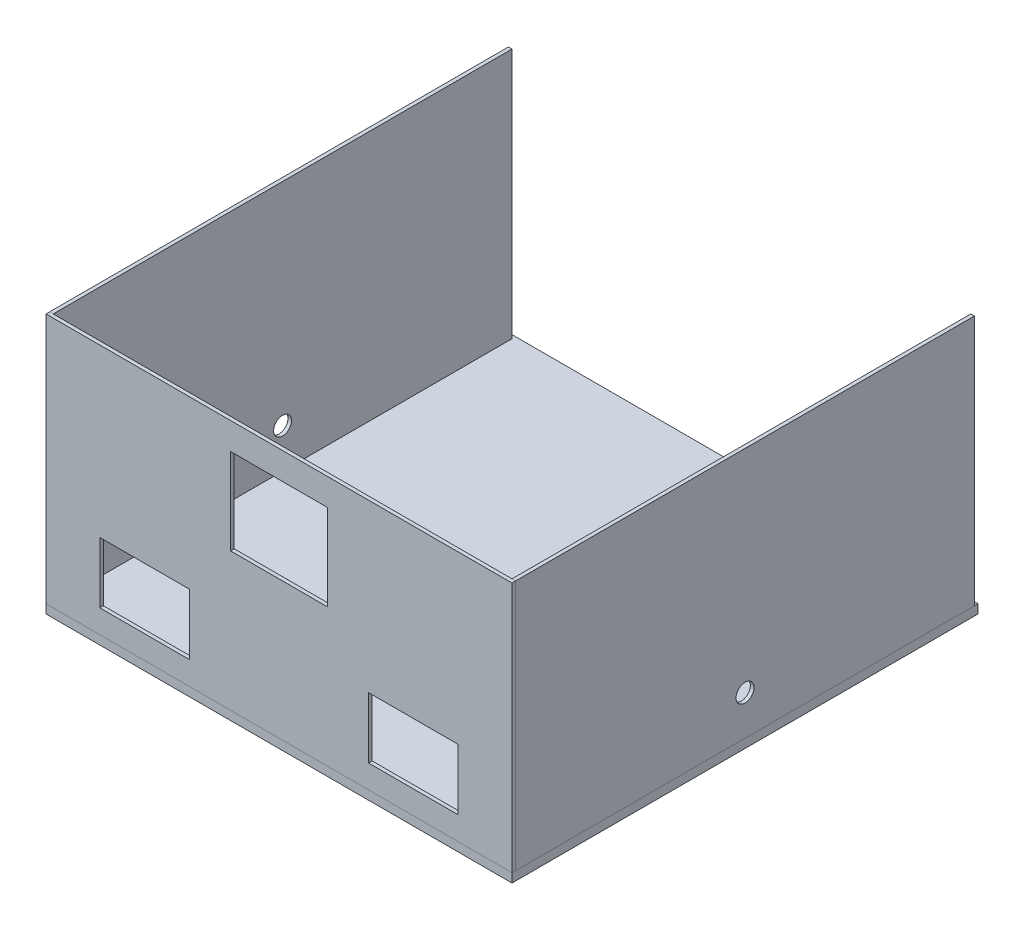
ISO-10303-21;
HEADER;
FILE_DESCRIPTION(('STEP AP214'),'2;1');
FILE_NAME('part.step','',(''),(''),'','','');
FILE_SCHEMA(('AUTOMOTIVE_DESIGN { 1 0 10303 214 1 1 1 1 }'));
ENDSEC;
DATA;
#1=APPLICATION_CONTEXT('core data for automotive mechanical design processes');
#2=APPLICATION_PROTOCOL_DEFINITION('international standard','automotive_design',2000,#1);
#3=PRODUCT_CONTEXT('',#1,'mechanical');
#4=PRODUCT('Part','Part','',(#3));
#5=PRODUCT_RELATED_PRODUCT_CATEGORY('part','',(#4));
#6=PRODUCT_DEFINITION_FORMATION('','',#4);
#7=PRODUCT_DEFINITION_CONTEXT('part definition',#1,'design');
#8=PRODUCT_DEFINITION('design','',#6,#7);
#9=PRODUCT_DEFINITION_SHAPE('','',#8);
#10=(LENGTH_UNIT() NAMED_UNIT(*) SI_UNIT(.MILLI.,.METRE.));
#11=(NAMED_UNIT(*) PLANE_ANGLE_UNIT() SI_UNIT($,.RADIAN.));
#12=(NAMED_UNIT(*) SI_UNIT($,.STERADIAN.) SOLID_ANGLE_UNIT());
#13=UNCERTAINTY_MEASURE_WITH_UNIT(LENGTH_MEASURE(1.E-05),#10,'distance_accuracy_value','');
#14=(GEOMETRIC_REPRESENTATION_CONTEXT(3) GLOBAL_UNCERTAINTY_ASSIGNED_CONTEXT((#13)) GLOBAL_UNIT_ASSIGNED_CONTEXT((#10,
#11,#12)) REPRESENTATION_CONTEXT('',''));
#15=CARTESIAN_POINT('',(0.,0.,0.));
#16=DIRECTION('',(0.,0.,1.));
#17=DIRECTION('',(1.,0.,0.));
#18=AXIS2_PLACEMENT_3D('',#15,#16,#17);
#19=CARTESIAN_POINT('',(124.072532436243,59.5515225903268,165.701661341962));
#20=DIRECTION('',(-1.,0.,0.));
#21=DIRECTION('',(0.,0.,1.));
#22=AXIS2_PLACEMENT_3D('',#19,#20,#21);
#23=PLANE('',#22);
#24=DIRECTION('',(0.,0.,-1.));
#25=VECTOR('',#24,1.);
#26=CARTESIAN_POINT('',(124.072532436243,57.0515225903268,165.701661341962));
#27=LINE('',#26,#25);
#28=CARTESIAN_POINT('',(124.072532436243,57.0515225903268,165.701661341962));
#29=VERTEX_POINT('',#28);
#30=CARTESIAN_POINT('',(124.072532436243,57.0515225903268,35.7016613419616));
#31=VERTEX_POINT('',#30);
#32=EDGE_CURVE('P0_E80',#29,#31,#27,.T.);
#33=ORIENTED_EDGE('',*,*,#32,.T.);
#34=DIRECTION('',(0.,-1.,0.));
#35=VECTOR('',#34,1.);
#36=CARTESIAN_POINT('',(124.072532436243,59.5515225903268,35.7016613419616));
#37=LINE('',#36,#35);
#38=CARTESIAN_POINT('',(124.072532436243,59.5515225903268,35.7016613419616));
#39=VERTEX_POINT('',#38);
#40=EDGE_CURVE('P0_E11',#39,#31,#37,.T.);
#41=ORIENTED_EDGE('',*,*,#40,.F.);
#42=DIRECTION('',(0.,0.,-1.));
#43=VECTOR('',#42,1.);
#44=CARTESIAN_POINT('',(124.072532436243,59.5515225903268,165.701661341962));
#45=LINE('',#44,#43);
#46=CARTESIAN_POINT('',(124.072532436243,59.5515225903268,165.701661341962));
#47=VERTEX_POINT('',#46);
#48=EDGE_CURVE('P0_E68',#47,#39,#45,.T.);
#49=ORIENTED_EDGE('',*,*,#48,.F.);
#50=DIRECTION('',(0.,-1.,0.));
#51=VECTOR('',#50,1.);
#52=CARTESIAN_POINT('',(124.072532436243,59.5515225903268,165.701661341962));
#53=LINE('',#52,#51);
#54=EDGE_CURVE('P0_E76',#47,#29,#53,.T.);
#55=ORIENTED_EDGE('',*,*,#54,.T.);
#56=EDGE_LOOP('',(#33,#41,#49,#55));
#57=FACE_BOUND('',#56,.T.);
#58=ADVANCED_FACE('P0_F17',(#57),#23,.F.);
#59=CARTESIAN_POINT('',(-5.92746756375711,59.5515225903268,35.7016613419616));
#60=DIRECTION('',(0.,0.,1.));
#61=DIRECTION('',(1.,0.,0.));
#62=AXIS2_PLACEMENT_3D('',#59,#60,#61);
#63=PLANE('',#62);
#64=DIRECTION('',(-1.,0.,0.));
#65=VECTOR('',#64,1.);
#66=CARTESIAN_POINT('',(-5.92746756375711,57.0515225903268,35.7016613419616));
#67=LINE('',#66,#65);
#68=CARTESIAN_POINT('',(-5.92746756375711,57.0515225903268,35.7016613419616));
#69=VERTEX_POINT('',#68);
#70=EDGE_CURVE('P0_E72',#31,#69,#67,.T.);
#71=ORIENTED_EDGE('',*,*,#70,.T.);
#72=DIRECTION('',(0.,-1.,0.));
#73=VECTOR('',#72,1.);
#74=CARTESIAN_POINT('',(-5.92746756375711,59.5515225903268,35.7016613419616));
#75=LINE('',#74,#73);
#76=CARTESIAN_POINT('',(-5.92746756375711,59.5515225903268,35.7016613419616));
#77=VERTEX_POINT('',#76);
#78=EDGE_CURVE('P0_E25',#77,#69,#75,.T.);
#79=ORIENTED_EDGE('',*,*,#78,.F.);
#80=DIRECTION('',(-1.,0.,0.));
#81=VECTOR('',#80,1.);
#82=CARTESIAN_POINT('',(-5.92746756375711,59.5515225903268,35.7016613419616));
#83=LINE('',#82,#81);
#84=EDGE_CURVE('P0_E63',#39,#77,#83,.T.);
#85=ORIENTED_EDGE('',*,*,#84,.F.);
#86=ORIENTED_EDGE('',*,*,#40,.T.);
#87=EDGE_LOOP('',(#71,#79,#85,#86));
#88=FACE_BOUND('',#87,.T.);
#89=ADVANCED_FACE('P0_F71',(#88),#63,.F.);
#90=CARTESIAN_POINT('',(-5.92746756375711,59.5515225903268,165.701661341962));
#91=DIRECTION('',(1.,0.,0.));
#92=DIRECTION('',(0.,0.,-1.));
#93=AXIS2_PLACEMENT_3D('',#90,#91,#92);
#94=PLANE('',#93);
#95=DIRECTION('',(0.,0.,1.));
#96=VECTOR('',#95,1.);
#97=CARTESIAN_POINT('',(-5.92746756375711,57.0515225903268,165.701661341962));
#98=LINE('',#97,#96);
#99=CARTESIAN_POINT('',(-5.92746756375711,57.0515225903268,165.701661341962));
#100=VERTEX_POINT('',#99);
#101=EDGE_CURVE('P0_E50',#69,#100,#98,.T.);
#102=ORIENTED_EDGE('',*,*,#101,.T.);
#103=DIRECTION('',(0.,-1.,0.));
#104=VECTOR('',#103,1.);
#105=CARTESIAN_POINT('',(-5.92746756375711,59.5515225903268,165.701661341962));
#106=LINE('',#105,#104);
#107=CARTESIAN_POINT('',(-5.92746756375711,59.5515225903268,165.701661341962));
#108=VERTEX_POINT('',#107);
#109=EDGE_CURVE('P0_E73',#108,#100,#106,.T.);
#110=ORIENTED_EDGE('',*,*,#109,.F.);
#111=DIRECTION('',(0.,0.,1.));
#112=VECTOR('',#111,1.);
#113=CARTESIAN_POINT('',(-5.92746756375711,59.5515225903268,165.701661341962));
#114=LINE('',#113,#112);
#115=EDGE_CURVE('P0_E66',#77,#108,#114,.T.);
#116=ORIENTED_EDGE('',*,*,#115,.F.);
#117=ORIENTED_EDGE('',*,*,#78,.T.);
#118=EDGE_LOOP('',(#102,#110,#116,#117));
#119=FACE_BOUND('',#118,.T.);
#120=ADVANCED_FACE('P0_F74',(#119),#94,.F.);
#121=CARTESIAN_POINT('',(-5.92746756375711,59.5515225903268,165.701661341962));
#122=DIRECTION('',(0.,0.,-1.));
#123=DIRECTION('',(-1.,0.,0.));
#124=AXIS2_PLACEMENT_3D('',#121,#122,#123);
#125=PLANE('',#124);
#126=DIRECTION('',(1.,0.,0.));
#127=VECTOR('',#126,1.);
#128=CARTESIAN_POINT('',(-5.92746756375711,57.0515225903268,165.701661341962));
#129=LINE('',#128,#127);
#130=EDGE_CURVE('P0_E56',#100,#29,#129,.T.);
#131=ORIENTED_EDGE('',*,*,#130,.T.);
#132=ORIENTED_EDGE('',*,*,#54,.F.);
#133=DIRECTION('',(1.,0.,0.));
#134=VECTOR('',#133,1.);
#135=CARTESIAN_POINT('',(-5.92746756375711,59.5515225903268,165.701661341962));
#136=LINE('',#135,#134);
#137=EDGE_CURVE('P0_E33',#108,#47,#136,.T.);
#138=ORIENTED_EDGE('',*,*,#137,.F.);
#139=ORIENTED_EDGE('',*,*,#109,.T.);
#140=EDGE_LOOP('',(#131,#132,#138,#139));
#141=FACE_BOUND('',#140,.T.);
#142=ADVANCED_FACE('P0_F87',(#141),#125,.F.);
#143=CARTESIAN_POINT('',(59.0725324362429,59.5515225903268,100.701661341962));
#144=DIRECTION('',(0.,-1.,0.));
#145=DIRECTION('',(0.,0.,-1.));
#146=AXIS2_PLACEMENT_3D('',#143,#144,#145);
#147=PLANE('',#146);
#148=ORIENTED_EDGE('',*,*,#48,.T.);
#149=ORIENTED_EDGE('',*,*,#84,.T.);
#150=ORIENTED_EDGE('',*,*,#115,.T.);
#151=ORIENTED_EDGE('',*,*,#137,.T.);
#152=EDGE_LOOP('',(#148,#149,#150,#151));
#153=FACE_BOUND('',#152,.T.);
#154=ADVANCED_FACE('P0_F64',(#153),#147,.F.);
#155=CARTESIAN_POINT('',(59.0725324362429,57.0515225903268,100.701661341962));
#156=DIRECTION('',(0.,-1.,0.));
#157=DIRECTION('',(0.,0.,-1.));
#158=AXIS2_PLACEMENT_3D('',#155,#156,#157);
#159=PLANE('',#158);
#160=ORIENTED_EDGE('',*,*,#32,.F.);
#161=ORIENTED_EDGE('',*,*,#130,.F.);
#162=ORIENTED_EDGE('',*,*,#101,.F.);
#163=ORIENTED_EDGE('',*,*,#70,.F.);
#164=EDGE_LOOP('',(#160,#161,#162,#163));
#165=FACE_BOUND('',#164,.T.);
#166=ADVANCED_FACE('P0_F90',(#165),#159,.T.);
#167=CLOSED_SHELL('',(#58,#89,#120,#142,#154,#166));
#168=MANIFOLD_SOLID_BREP('P0_B1',#167);
#169=CARTESIAN_POINT('',(124.072532436243,59.5515225903268,165.701661341962));
#170=DIRECTION('',(-1.,0.,0.));
#171=DIRECTION('',(0.,0.,1.));
#172=AXIS2_PLACEMENT_3D('',#169,#170,#171);
#173=PLANE('',#172);
#174=DIRECTION('',(0.,1.,0.));
#175=VECTOR('',#174,1.);
#176=CARTESIAN_POINT('',(124.072532436243,59.5515225903268,164.701661341962));
#177=LINE('',#176,#175);
#178=CARTESIAN_POINT('',(124.072532436243,59.5515225903268,164.701661341962));
#179=VERTEX_POINT('',#178);
#180=CARTESIAN_POINT('',(124.072532436243,129.551522590327,164.701661341962));
#181=VERTEX_POINT('',#180);
#182=EDGE_CURVE('P1_E165',#179,#181,#177,.T.);
#183=ORIENTED_EDGE('',*,*,#182,.T.);
#184=DIRECTION('',(0.,0.,-1.));
#185=VECTOR('',#184,1.);
#186=CARTESIAN_POINT('',(124.072532436243,129.551522590327,165.701661341962));
#187=LINE('',#186,#185);
#188=CARTESIAN_POINT('',(124.072532436243,129.551522590327,165.701661341962));
#189=VERTEX_POINT('',#188);
#190=EDGE_CURVE('P1_E10',#189,#181,#187,.T.);
#191=ORIENTED_EDGE('',*,*,#190,.F.);
#192=DIRECTION('',(0.,1.,0.));
#193=VECTOR('',#192,1.);
#194=CARTESIAN_POINT('',(124.072532436243,59.5515225903268,165.701661341962));
#195=LINE('',#194,#193);
#196=CARTESIAN_POINT('',(124.072532436243,59.5515225903268,165.701661341962));
#197=VERTEX_POINT('',#196);
#198=EDGE_CURVE('P1_E230',#197,#189,#195,.T.);
#199=ORIENTED_EDGE('',*,*,#198,.F.);
#200=DIRECTION('',(0.,0.,-1.));
#201=VECTOR('',#200,1.);
#202=CARTESIAN_POINT('',(124.072532436243,59.5515225903268,165.701661341962));
#203=LINE('',#202,#201);
#204=EDGE_CURVE('P1_E240',#197,#179,#203,.T.);
#205=ORIENTED_EDGE('',*,*,#204,.T.);
#206=EDGE_LOOP('',(#183,#191,#199,#205));
#207=FACE_BOUND('',#206,.T.);
#208=ADVANCED_FACE('P1_F16',(#207),#173,.F.);
#209=CARTESIAN_POINT('',(-5.92746756375711,129.551522590327,165.701661341962));
#210=DIRECTION('',(0.,-1.,0.));
#211=DIRECTION('',(0.,0.,-1.));
#212=AXIS2_PLACEMENT_3D('',#209,#210,#211);
#213=PLANE('',#212);
#214=DIRECTION('',(-1.,0.,0.));
#215=VECTOR('',#214,1.);
#216=CARTESIAN_POINT('',(-5.92746756375711,129.551522590327,164.701661341962));
#217=LINE('',#216,#215);
#218=CARTESIAN_POINT('',(-5.92746756375711,129.551522590327,164.701661341962));
#219=VERTEX_POINT('',#218);
#220=EDGE_CURVE('P1_E243',#181,#219,#217,.T.);
#221=ORIENTED_EDGE('',*,*,#220,.T.);
#222=DIRECTION('',(0.,0.,-1.));
#223=VECTOR('',#222,1.);
#224=CARTESIAN_POINT('',(-5.92746756375711,129.551522590327,165.701661341962));
#225=LINE('',#224,#223);
#226=CARTESIAN_POINT('',(-5.92746756375711,129.551522590327,165.701661341962));
#227=VERTEX_POINT('',#226);
#228=EDGE_CURVE('P1_E23',#227,#219,#225,.T.);
#229=ORIENTED_EDGE('',*,*,#228,.F.);
#230=DIRECTION('',(-1.,0.,0.));
#231=VECTOR('',#230,1.);
#232=CARTESIAN_POINT('',(-5.92746756375711,129.551522590327,165.701661341962));
#233=LINE('',#232,#231);
#234=EDGE_CURVE('P1_E233',#189,#227,#233,.T.);
#235=ORIENTED_EDGE('',*,*,#234,.F.);
#236=ORIENTED_EDGE('',*,*,#190,.T.);
#237=EDGE_LOOP('',(#221,#229,#235,#236));
#238=FACE_BOUND('',#237,.T.);
#239=ADVANCED_FACE('P1_F272',(#238),#213,.F.);
#240=CARTESIAN_POINT('',(-5.92746756375711,59.5515225903268,165.701661341962));
#241=DIRECTION('',(1.,0.,0.));
#242=DIRECTION('',(0.,0.,-1.));
#243=AXIS2_PLACEMENT_3D('',#240,#241,#242);
#244=PLANE('',#243);
#245=DIRECTION('',(0.,-1.,0.));
#246=VECTOR('',#245,1.);
#247=CARTESIAN_POINT('',(-5.92746756375711,59.5515225903268,164.701661341962));
#248=LINE('',#247,#246);
#249=CARTESIAN_POINT('',(-5.92746756375711,59.5515225903268,164.701661341962));
#250=VERTEX_POINT('',#249);
#251=EDGE_CURVE('P1_E245',#219,#250,#248,.T.);
#252=ORIENTED_EDGE('',*,*,#251,.T.);
#253=DIRECTION('',(0.,0.,-1.));
#254=VECTOR('',#253,1.);
#255=CARTESIAN_POINT('',(-5.92746756375711,59.5515225903268,165.701661341962));
#256=LINE('',#255,#254);
#257=CARTESIAN_POINT('',(-5.92746756375711,59.5515225903268,165.701661341962));
#258=VERTEX_POINT('',#257);
#259=EDGE_CURVE('P1_E250',#258,#250,#256,.T.);
#260=ORIENTED_EDGE('',*,*,#259,.F.);
#261=DIRECTION('',(0.,-1.,0.));
#262=VECTOR('',#261,1.);
#263=CARTESIAN_POINT('',(-5.92746756375711,59.5515225903268,165.701661341962));
#264=LINE('',#263,#262);
#265=EDGE_CURVE('P1_E236',#227,#258,#264,.T.);
#266=ORIENTED_EDGE('',*,*,#265,.F.);
#267=ORIENTED_EDGE('',*,*,#228,.T.);
#268=EDGE_LOOP('',(#252,#260,#266,#267));
#269=FACE_BOUND('',#268,.T.);
#270=ADVANCED_FACE('P1_F257',(#269),#244,.F.);
#271=CARTESIAN_POINT('',(-5.92746756375711,59.5515225903268,165.701661341962));
#272=DIRECTION('',(0.,1.,0.));
#273=DIRECTION('',(0.,0.,1.));
#274=AXIS2_PLACEMENT_3D('',#271,#272,#273);
#275=PLANE('',#274);
#276=DIRECTION('',(1.,0.,0.));
#277=VECTOR('',#276,1.);
#278=CARTESIAN_POINT('',(-5.92746756375711,59.5515225903268,164.701661341962));
#279=LINE('',#278,#277);
#280=EDGE_CURVE('P1_E234',#250,#179,#279,.T.);
#281=ORIENTED_EDGE('',*,*,#280,.T.);
#282=ORIENTED_EDGE('',*,*,#204,.F.);
#283=DIRECTION('',(1.,0.,0.));
#284=VECTOR('',#283,1.);
#285=CARTESIAN_POINT('',(-5.92746756375711,59.5515225903268,165.701661341962));
#286=LINE('',#285,#284);
#287=EDGE_CURVE('P1_E238',#258,#197,#286,.T.);
#288=ORIENTED_EDGE('',*,*,#287,.F.);
#289=ORIENTED_EDGE('',*,*,#259,.T.);
#290=EDGE_LOOP('',(#281,#282,#288,#289));
#291=FACE_BOUND('',#290,.T.);
#292=ADVANCED_FACE('P1_F265',(#291),#275,.F.);
#293=CARTESIAN_POINT('',(59.0725324362429,94.5515225903268,165.701661341962));
#294=DIRECTION('',(0.,0.,-1.));
#295=DIRECTION('',(-1.,0.,0.));
#296=AXIS2_PLACEMENT_3D('',#293,#294,#295);
#297=PLANE('',#296);
#298=DIRECTION('',(-1.,0.,0.));
#299=VECTOR('',#298,1.);
#300=CARTESIAN_POINT('',(9.07253243624289,83.0515225903268,165.701661341962));
#301=LINE('',#300,#299);
#302=CARTESIAN_POINT('',(34.0725324362429,83.0515225903268,165.701661341962));
#303=VERTEX_POINT('',#302);
#304=CARTESIAN_POINT('',(9.07253243624289,83.0515225903268,165.701661341962));
#305=VERTEX_POINT('',#304);
#306=EDGE_CURVE('P1_E158',#303,#305,#301,.T.);
#307=ORIENTED_EDGE('',*,*,#306,.F.);
#308=DIRECTION('',(0.,1.,0.));
#309=VECTOR('',#308,1.);
#310=CARTESIAN_POINT('',(34.0725324362429,66.0515225903268,165.701661341962));
#311=LINE('',#310,#309);
#312=CARTESIAN_POINT('',(34.0725324362429,66.0515225903268,165.701661341962));
#313=VERTEX_POINT('',#312);
#314=EDGE_CURVE('P1_E30',#313,#303,#311,.T.);
#315=ORIENTED_EDGE('',*,*,#314,.F.);
#316=DIRECTION('',(1.,0.,0.));
#317=VECTOR('',#316,1.);
#318=CARTESIAN_POINT('',(9.07253243624289,66.0515225903268,165.701661341962));
#319=LINE('',#318,#317);
#320=CARTESIAN_POINT('',(9.07253243624289,66.0515225903268,165.701661341962));
#321=VERTEX_POINT('',#320);
#322=EDGE_CURVE('P1_E149',#321,#313,#319,.T.);
#323=ORIENTED_EDGE('',*,*,#322,.F.);
#324=DIRECTION('',(0.,-1.,0.));
#325=VECTOR('',#324,1.);
#326=CARTESIAN_POINT('',(9.07253243624289,66.0515225903268,165.701661341962));
#327=LINE('',#326,#325);
#328=EDGE_CURVE('P1_E152',#305,#321,#327,.T.);
#329=ORIENTED_EDGE('',*,*,#328,.F.);
#330=EDGE_LOOP('',(#307,#315,#323,#329));
#331=FACE_BOUND('',#330,.T.);
#332=DIRECTION('',(-1.,0.,0.));
#333=VECTOR('',#332,1.);
#334=CARTESIAN_POINT('',(84.0725324362429,83.0515225903268,165.701661341962));
#335=LINE('',#334,#333);
#336=CARTESIAN_POINT('',(109.072532436243,83.0515225903268,165.701661341962));
#337=VERTEX_POINT('',#336);
#338=CARTESIAN_POINT('',(84.0725324362429,83.0515225903268,165.701661341962));
#339=VERTEX_POINT('',#338);
#340=EDGE_CURVE('P1_E184',#337,#339,#335,.T.);
#341=ORIENTED_EDGE('',*,*,#340,.F.);
#342=DIRECTION('',(0.,1.,0.));
#343=VECTOR('',#342,1.);
#344=CARTESIAN_POINT('',(109.072532436243,66.0515225903268,165.701661341962));
#345=LINE('',#344,#343);
#346=CARTESIAN_POINT('',(109.072532436243,66.0515225903268,165.701661341962));
#347=VERTEX_POINT('',#346);
#348=EDGE_CURVE('P1_E38',#347,#337,#345,.T.);
#349=ORIENTED_EDGE('',*,*,#348,.F.);
#350=DIRECTION('',(1.,0.,0.));
#351=VECTOR('',#350,1.);
#352=CARTESIAN_POINT('',(84.0725324362429,66.0515225903268,165.701661341962));
#353=LINE('',#352,#351);
#354=CARTESIAN_POINT('',(84.0725324362429,66.0515225903268,165.701661341962));
#355=VERTEX_POINT('',#354);
#356=EDGE_CURVE('P1_E173',#355,#347,#353,.T.);
#357=ORIENTED_EDGE('',*,*,#356,.F.);
#358=DIRECTION('',(0.,-1.,0.));
#359=VECTOR('',#358,1.);
#360=CARTESIAN_POINT('',(84.0725324362429,66.0515225903268,165.701661341962));
#361=LINE('',#360,#359);
#362=EDGE_CURVE('P1_E188',#339,#355,#361,.T.);
#363=ORIENTED_EDGE('',*,*,#362,.F.);
#364=EDGE_LOOP('',(#341,#349,#357,#363));
#365=FACE_BOUND('',#364,.T.);
#366=DIRECTION('',(-1.,0.,0.));
#367=VECTOR('',#366,1.);
#368=CARTESIAN_POINT('',(45.5725324362429,122.051522590327,165.701661341962));
#369=LINE('',#368,#367);
#370=CARTESIAN_POINT('',(72.5725324362429,122.051522590327,165.701661341962));
#371=VERTEX_POINT('',#370);
#372=CARTESIAN_POINT('',(45.5725324362429,122.051522590327,165.701661341962));
#373=VERTEX_POINT('',#372);
#374=EDGE_CURVE('P1_E215',#371,#373,#369,.T.);
#375=ORIENTED_EDGE('',*,*,#374,.F.);
#376=DIRECTION('',(0.,1.,0.));
#377=VECTOR('',#376,1.);
#378=CARTESIAN_POINT('',(72.5725324362429,98.0515225903268,165.701661341962));
#379=LINE('',#378,#377);
#380=CARTESIAN_POINT('',(72.5725324362429,98.0515225903268,165.701661341962));
#381=VERTEX_POINT('',#380);
#382=EDGE_CURVE('P1_E213',#381,#371,#379,.T.);
#383=ORIENTED_EDGE('',*,*,#382,.F.);
#384=DIRECTION('',(1.,0.,0.));
#385=VECTOR('',#384,1.);
#386=CARTESIAN_POINT('',(45.5725324362429,98.0515225903268,165.701661341962));
#387=LINE('',#386,#385);
#388=CARTESIAN_POINT('',(45.5725324362429,98.0515225903268,165.701661341962));
#389=VERTEX_POINT('',#388);
#390=EDGE_CURVE('P1_E203',#389,#381,#387,.T.);
#391=ORIENTED_EDGE('',*,*,#390,.F.);
#392=DIRECTION('',(0.,-1.,0.));
#393=VECTOR('',#392,1.);
#394=CARTESIAN_POINT('',(45.5725324362429,98.0515225903268,165.701661341962));
#395=LINE('',#394,#393);
#396=EDGE_CURVE('P1_E218',#373,#389,#395,.T.);
#397=ORIENTED_EDGE('',*,*,#396,.F.);
#398=EDGE_LOOP('',(#375,#383,#391,#397));
#399=FACE_BOUND('',#398,.T.);
#400=ORIENTED_EDGE('',*,*,#198,.T.);
#401=ORIENTED_EDGE('',*,*,#234,.T.);
#402=ORIENTED_EDGE('',*,*,#265,.T.);
#403=ORIENTED_EDGE('',*,*,#287,.T.);
#404=EDGE_LOOP('',(#400,#401,#402,#403));
#405=FACE_BOUND('',#404,.T.);
#406=ADVANCED_FACE('P1_F271',(#331,#365,#399,#405),#297,.F.);
#407=CARTESIAN_POINT('',(59.0725324362429,94.5515225903268,164.701661341962));
#408=DIRECTION('',(0.,0.,-1.));
#409=DIRECTION('',(-1.,0.,0.));
#410=AXIS2_PLACEMENT_3D('',#407,#408,#409);
#411=PLANE('',#410);
#412=DIRECTION('',(0.,1.,0.));
#413=VECTOR('',#412,1.);
#414=CARTESIAN_POINT('',(34.0725324362429,66.0515225903268,164.701661341962));
#415=LINE('',#414,#413);
#416=CARTESIAN_POINT('',(34.0725324362429,66.0515225903268,164.701661341962));
#417=VERTEX_POINT('',#416);
#418=CARTESIAN_POINT('',(34.0725324362429,83.0515225903268,164.701661341962));
#419=VERTEX_POINT('',#418);
#420=EDGE_CURVE('P1_E130',#417,#419,#415,.T.);
#421=ORIENTED_EDGE('',*,*,#420,.T.);
#422=DIRECTION('',(-1.,0.,0.));
#423=VECTOR('',#422,1.);
#424=CARTESIAN_POINT('',(9.07253243624289,83.0515225903268,164.701661341962));
#425=LINE('',#424,#423);
#426=CARTESIAN_POINT('',(9.07253243624289,83.0515225903268,164.701661341962));
#427=VERTEX_POINT('',#426);
#428=EDGE_CURVE('P1_E140',#419,#427,#425,.T.);
#429=ORIENTED_EDGE('',*,*,#428,.T.);
#430=DIRECTION('',(0.,-1.,0.));
#431=VECTOR('',#430,1.);
#432=CARTESIAN_POINT('',(9.07253243624289,66.0515225903268,164.701661341962));
#433=LINE('',#432,#431);
#434=CARTESIAN_POINT('',(9.07253243624289,66.0515225903268,164.701661341962));
#435=VERTEX_POINT('',#434);
#436=EDGE_CURVE('P1_E144',#427,#435,#433,.T.);
#437=ORIENTED_EDGE('',*,*,#436,.T.);
#438=DIRECTION('',(1.,0.,0.));
#439=VECTOR('',#438,1.);
#440=CARTESIAN_POINT('',(9.07253243624289,66.0515225903268,164.701661341962));
#441=LINE('',#440,#439);
#442=EDGE_CURVE('P1_E136',#435,#417,#441,.T.);
#443=ORIENTED_EDGE('',*,*,#442,.T.);
#444=EDGE_LOOP('',(#421,#429,#437,#443));
#445=FACE_BOUND('',#444,.T.);
#446=DIRECTION('',(0.,1.,0.));
#447=VECTOR('',#446,1.);
#448=CARTESIAN_POINT('',(109.072532436243,66.0515225903268,164.701661341962));
#449=LINE('',#448,#447);
#450=CARTESIAN_POINT('',(109.072532436243,66.0515225903268,164.701661341962));
#451=VERTEX_POINT('',#450);
#452=CARTESIAN_POINT('',(109.072532436243,83.0515225903268,164.701661341962));
#453=VERTEX_POINT('',#452);
#454=EDGE_CURVE('P1_E169',#451,#453,#449,.T.);
#455=ORIENTED_EDGE('',*,*,#454,.T.);
#456=DIRECTION('',(-1.,0.,0.));
#457=VECTOR('',#456,1.);
#458=CARTESIAN_POINT('',(84.0725324362429,83.0515225903268,164.701661341962));
#459=LINE('',#458,#457);
#460=CARTESIAN_POINT('',(84.0725324362429,83.0515225903268,164.701661341962));
#461=VERTEX_POINT('',#460);
#462=EDGE_CURVE('P1_E172',#453,#461,#459,.T.);
#463=ORIENTED_EDGE('',*,*,#462,.T.);
#464=DIRECTION('',(0.,-1.,0.));
#465=VECTOR('',#464,1.);
#466=CARTESIAN_POINT('',(84.0725324362429,66.0515225903268,164.701661341962));
#467=LINE('',#466,#465);
#468=CARTESIAN_POINT('',(84.0725324362429,66.0515225903268,164.701661341962));
#469=VERTEX_POINT('',#468);
#470=EDGE_CURVE('P1_E176',#461,#469,#467,.T.);
#471=ORIENTED_EDGE('',*,*,#470,.T.);
#472=DIRECTION('',(1.,0.,0.));
#473=VECTOR('',#472,1.);
#474=CARTESIAN_POINT('',(84.0725324362429,66.0515225903268,164.701661341962));
#475=LINE('',#474,#473);
#476=EDGE_CURVE('P1_E179',#469,#451,#475,.T.);
#477=ORIENTED_EDGE('',*,*,#476,.T.);
#478=EDGE_LOOP('',(#455,#463,#471,#477));
#479=FACE_BOUND('',#478,.T.);
#480=DIRECTION('',(0.,1.,0.));
#481=VECTOR('',#480,1.);
#482=CARTESIAN_POINT('',(72.5725324362429,98.0515225903268,164.701661341962));
#483=LINE('',#482,#481);
#484=CARTESIAN_POINT('',(72.5725324362429,98.0515225903268,164.701661341962));
#485=VERTEX_POINT('',#484);
#486=CARTESIAN_POINT('',(72.5725324362429,122.051522590327,164.701661341962));
#487=VERTEX_POINT('',#486);
#488=EDGE_CURVE('P1_E199',#485,#487,#483,.T.);
#489=ORIENTED_EDGE('',*,*,#488,.T.);
#490=DIRECTION('',(-1.,0.,0.));
#491=VECTOR('',#490,1.);
#492=CARTESIAN_POINT('',(45.5725324362429,122.051522590327,164.701661341962));
#493=LINE('',#492,#491);
#494=CARTESIAN_POINT('',(45.5725324362429,122.051522590327,164.701661341962));
#495=VERTEX_POINT('',#494);
#496=EDGE_CURVE('P1_E202',#487,#495,#493,.T.);
#497=ORIENTED_EDGE('',*,*,#496,.T.);
#498=DIRECTION('',(0.,-1.,0.));
#499=VECTOR('',#498,1.);
#500=CARTESIAN_POINT('',(45.5725324362429,98.0515225903268,164.701661341962));
#501=LINE('',#500,#499);
#502=CARTESIAN_POINT('',(45.5725324362429,98.0515225903268,164.701661341962));
#503=VERTEX_POINT('',#502);
#504=EDGE_CURVE('P1_E206',#495,#503,#501,.T.);
#505=ORIENTED_EDGE('',*,*,#504,.T.);
#506=DIRECTION('',(1.,0.,0.));
#507=VECTOR('',#506,1.);
#508=CARTESIAN_POINT('',(45.5725324362429,98.0515225903268,164.701661341962));
#509=LINE('',#508,#507);
#510=EDGE_CURVE('P1_E209',#503,#485,#509,.T.);
#511=ORIENTED_EDGE('',*,*,#510,.T.);
#512=EDGE_LOOP('',(#489,#497,#505,#511));
#513=FACE_BOUND('',#512,.T.);
#514=ORIENTED_EDGE('',*,*,#182,.F.);
#515=ORIENTED_EDGE('',*,*,#280,.F.);
#516=ORIENTED_EDGE('',*,*,#251,.F.);
#517=ORIENTED_EDGE('',*,*,#220,.F.);
#518=EDGE_LOOP('',(#514,#515,#516,#517));
#519=FACE_BOUND('',#518,.T.);
#520=ADVANCED_FACE('P1_F146',(#445,#479,#513,#519),#411,.T.);
#521=CARTESIAN_POINT('',(72.5725324362429,98.0515225903268,164.701661341962));
#522=DIRECTION('',(1.,0.,0.));
#523=DIRECTION('',(0.,0.,-1.));
#524=AXIS2_PLACEMENT_3D('',#521,#522,#523);
#525=PLANE('',#524);
#526=ORIENTED_EDGE('',*,*,#382,.T.);
#527=DIRECTION('',(0.,0.,1.));
#528=VECTOR('',#527,1.);
#529=CARTESIAN_POINT('',(72.5725324362429,122.051522590327,164.701661341962));
#530=LINE('',#529,#528);
#531=EDGE_CURVE('P1_E212',#487,#371,#530,.T.);
#532=ORIENTED_EDGE('',*,*,#531,.F.);
#533=ORIENTED_EDGE('',*,*,#488,.F.);
#534=DIRECTION('',(0.,0.,1.));
#535=VECTOR('',#534,1.);
#536=CARTESIAN_POINT('',(72.5725324362429,98.0515225903268,164.701661341962));
#537=LINE('',#536,#535);
#538=EDGE_CURVE('P1_E185',#485,#381,#537,.T.);
#539=ORIENTED_EDGE('',*,*,#538,.T.);
#540=EDGE_LOOP('',(#526,#532,#533,#539));
#541=FACE_BOUND('',#540,.T.);
#542=ADVANCED_FACE('P1_F285',(#541),#525,.F.);
#543=CARTESIAN_POINT('',(45.5725324362429,98.0515225903268,164.701661341962));
#544=DIRECTION('',(0.,-1.,0.));
#545=DIRECTION('',(0.,0.,-1.));
#546=AXIS2_PLACEMENT_3D('',#543,#544,#545);
#547=PLANE('',#546);
#548=ORIENTED_EDGE('',*,*,#390,.T.);
#549=ORIENTED_EDGE('',*,*,#538,.F.);
#550=ORIENTED_EDGE('',*,*,#510,.F.);
#551=DIRECTION('',(0.,0.,1.));
#552=VECTOR('',#551,1.);
#553=CARTESIAN_POINT('',(45.5725324362429,98.0515225903268,164.701661341962));
#554=LINE('',#553,#552);
#555=EDGE_CURVE('P1_E224',#503,#389,#554,.T.);
#556=ORIENTED_EDGE('',*,*,#555,.T.);
#557=EDGE_LOOP('',(#548,#549,#550,#556));
#558=FACE_BOUND('',#557,.T.);
#559=ADVANCED_FACE('P1_F291',(#558),#547,.F.);
#560=CARTESIAN_POINT('',(45.5725324362429,98.0515225903268,164.701661341962));
#561=DIRECTION('',(-1.,0.,0.));
#562=DIRECTION('',(0.,0.,1.));
#563=AXIS2_PLACEMENT_3D('',#560,#561,#562);
#564=PLANE('',#563);
#565=ORIENTED_EDGE('',*,*,#396,.T.);
#566=ORIENTED_EDGE('',*,*,#555,.F.);
#567=ORIENTED_EDGE('',*,*,#504,.F.);
#568=DIRECTION('',(0.,0.,1.));
#569=VECTOR('',#568,1.);
#570=CARTESIAN_POINT('',(45.5725324362429,122.051522590327,164.701661341962));
#571=LINE('',#570,#569);
#572=EDGE_CURVE('P1_E226',#495,#373,#571,.T.);
#573=ORIENTED_EDGE('',*,*,#572,.T.);
#574=EDGE_LOOP('',(#565,#566,#567,#573));
#575=FACE_BOUND('',#574,.T.);
#576=ADVANCED_FACE('P1_F297',(#575),#564,.F.);
#577=CARTESIAN_POINT('',(45.5725324362429,122.051522590327,164.701661341962));
#578=DIRECTION('',(0.,1.,0.));
#579=DIRECTION('',(0.,0.,1.));
#580=AXIS2_PLACEMENT_3D('',#577,#578,#579);
#581=PLANE('',#580);
#582=ORIENTED_EDGE('',*,*,#374,.T.);
#583=ORIENTED_EDGE('',*,*,#572,.F.);
#584=ORIENTED_EDGE('',*,*,#496,.F.);
#585=ORIENTED_EDGE('',*,*,#531,.T.);
#586=EDGE_LOOP('',(#582,#583,#584,#585));
#587=FACE_BOUND('',#586,.T.);
#588=ADVANCED_FACE('P1_F293',(#587),#581,.F.);
#589=CARTESIAN_POINT('',(109.072532436243,66.0515225903268,164.701661341962));
#590=DIRECTION('',(1.,0.,0.));
#591=DIRECTION('',(0.,0.,-1.));
#592=AXIS2_PLACEMENT_3D('',#589,#590,#591);
#593=PLANE('',#592);
#594=ORIENTED_EDGE('',*,*,#348,.T.);
#595=DIRECTION('',(0.,0.,1.));
#596=VECTOR('',#595,1.);
#597=CARTESIAN_POINT('',(109.072532436243,83.0515225903268,164.701661341962));
#598=LINE('',#597,#596);
#599=EDGE_CURVE('P1_E182',#453,#337,#598,.T.);
#600=ORIENTED_EDGE('',*,*,#599,.F.);
#601=ORIENTED_EDGE('',*,*,#454,.F.);
#602=DIRECTION('',(0.,0.,1.));
#603=VECTOR('',#602,1.);
#604=CARTESIAN_POINT('',(109.072532436243,66.0515225903268,164.701661341962));
#605=LINE('',#604,#603);
#606=EDGE_CURVE('P1_E159',#451,#347,#605,.T.);
#607=ORIENTED_EDGE('',*,*,#606,.T.);
#608=EDGE_LOOP('',(#594,#600,#601,#607));
#609=FACE_BOUND('',#608,.T.);
#610=ADVANCED_FACE('P1_F296',(#609),#593,.F.);
#611=CARTESIAN_POINT('',(84.0725324362429,66.0515225903268,164.701661341962));
#612=DIRECTION('',(0.,-1.,0.));
#613=DIRECTION('',(0.,0.,-1.));
#614=AXIS2_PLACEMENT_3D('',#611,#612,#613);
#615=PLANE('',#614);
#616=ORIENTED_EDGE('',*,*,#356,.T.);
#617=ORIENTED_EDGE('',*,*,#606,.F.);
#618=ORIENTED_EDGE('',*,*,#476,.F.);
#619=DIRECTION('',(0.,0.,1.));
#620=VECTOR('',#619,1.);
#621=CARTESIAN_POINT('',(84.0725324362429,66.0515225903268,164.701661341962));
#622=LINE('',#621,#620);
#623=EDGE_CURVE('P1_E194',#469,#355,#622,.T.);
#624=ORIENTED_EDGE('',*,*,#623,.T.);
#625=EDGE_LOOP('',(#616,#617,#618,#624));
#626=FACE_BOUND('',#625,.T.);
#627=ADVANCED_FACE('P1_F307',(#626),#615,.F.);
#628=CARTESIAN_POINT('',(84.0725324362429,66.0515225903268,164.701661341962));
#629=DIRECTION('',(-1.,0.,0.));
#630=DIRECTION('',(0.,0.,1.));
#631=AXIS2_PLACEMENT_3D('',#628,#629,#630);
#632=PLANE('',#631);
#633=ORIENTED_EDGE('',*,*,#362,.T.);
#634=ORIENTED_EDGE('',*,*,#623,.F.);
#635=ORIENTED_EDGE('',*,*,#470,.F.);
#636=DIRECTION('',(0.,0.,1.));
#637=VECTOR('',#636,1.);
#638=CARTESIAN_POINT('',(84.0725324362429,83.0515225903268,164.701661341962));
#639=LINE('',#638,#637);
#640=EDGE_CURVE('P1_E196',#461,#339,#639,.T.);
#641=ORIENTED_EDGE('',*,*,#640,.T.);
#642=EDGE_LOOP('',(#633,#634,#635,#641));
#643=FACE_BOUND('',#642,.T.);
#644=ADVANCED_FACE('P1_F311',(#643),#632,.F.);
#645=CARTESIAN_POINT('',(84.0725324362429,83.0515225903268,164.701661341962));
#646=DIRECTION('',(0.,1.,0.));
#647=DIRECTION('',(0.,0.,1.));
#648=AXIS2_PLACEMENT_3D('',#645,#646,#647);
#649=PLANE('',#648);
#650=ORIENTED_EDGE('',*,*,#340,.T.);
#651=ORIENTED_EDGE('',*,*,#640,.F.);
#652=ORIENTED_EDGE('',*,*,#462,.F.);
#653=ORIENTED_EDGE('',*,*,#599,.T.);
#654=EDGE_LOOP('',(#650,#651,#652,#653));
#655=FACE_BOUND('',#654,.T.);
#656=ADVANCED_FACE('P1_F308',(#655),#649,.F.);
#657=CARTESIAN_POINT('',(34.0725324362429,66.0515225903268,164.701661341962));
#658=DIRECTION('',(1.,0.,0.));
#659=DIRECTION('',(0.,1.,0.));
#660=AXIS2_PLACEMENT_3D('',#657,#658,#659);
#661=PLANE('',#660);
#662=ORIENTED_EDGE('',*,*,#314,.T.);
#663=DIRECTION('',(0.,0.,1.));
#664=VECTOR('',#663,1.);
#665=CARTESIAN_POINT('',(34.0725324362429,83.0515225903268,164.701661341962));
#666=LINE('',#665,#664);
#667=EDGE_CURVE('P1_E126',#419,#303,#666,.T.);
#668=ORIENTED_EDGE('',*,*,#667,.F.);
#669=ORIENTED_EDGE('',*,*,#420,.F.);
#670=DIRECTION('',(0.,0.,1.));
#671=VECTOR('',#670,1.);
#672=CARTESIAN_POINT('',(34.0725324362429,66.0515225903268,164.701661341962));
#673=LINE('',#672,#671);
#674=EDGE_CURVE('P1_E163',#417,#313,#673,.T.);
#675=ORIENTED_EDGE('',*,*,#674,.T.);
#676=EDGE_LOOP('',(#662,#668,#669,#675));
#677=FACE_BOUND('',#676,.T.);
#678=ADVANCED_FACE('P1_F128',(#677),#661,.F.);
#679=CARTESIAN_POINT('',(9.07253243624289,66.0515225903268,164.701661341962));
#680=DIRECTION('',(0.,-1.,0.));
#681=DIRECTION('',(0.,0.,-1.));
#682=AXIS2_PLACEMENT_3D('',#679,#680,#681);
#683=PLANE('',#682);
#684=ORIENTED_EDGE('',*,*,#322,.T.);
#685=ORIENTED_EDGE('',*,*,#674,.F.);
#686=ORIENTED_EDGE('',*,*,#442,.F.);
#687=DIRECTION('',(0.,0.,1.));
#688=VECTOR('',#687,1.);
#689=CARTESIAN_POINT('',(9.07253243624289,66.0515225903268,164.701661341962));
#690=LINE('',#689,#688);
#691=EDGE_CURVE('P1_E166',#435,#321,#690,.T.);
#692=ORIENTED_EDGE('',*,*,#691,.T.);
#693=EDGE_LOOP('',(#684,#685,#686,#692));
#694=FACE_BOUND('',#693,.T.);
#695=ADVANCED_FACE('P1_F321',(#694),#683,.F.);
#696=CARTESIAN_POINT('',(9.07253243624289,66.0515225903268,164.701661341962));
#697=DIRECTION('',(-1.,0.,0.));
#698=DIRECTION('',(0.,0.,1.));
#699=AXIS2_PLACEMENT_3D('',#696,#697,#698);
#700=PLANE('',#699);
#701=ORIENTED_EDGE('',*,*,#328,.T.);
#702=ORIENTED_EDGE('',*,*,#691,.F.);
#703=ORIENTED_EDGE('',*,*,#436,.F.);
#704=DIRECTION('',(0.,0.,1.));
#705=VECTOR('',#704,1.);
#706=CARTESIAN_POINT('',(9.07253243624289,83.0515225903268,164.701661341962));
#707=LINE('',#706,#705);
#708=EDGE_CURVE('P1_E135',#427,#305,#707,.T.);
#709=ORIENTED_EDGE('',*,*,#708,.T.);
#710=EDGE_LOOP('',(#701,#702,#703,#709));
#711=FACE_BOUND('',#710,.T.);
#712=ADVANCED_FACE('P1_F324',(#711),#700,.F.);
#713=CARTESIAN_POINT('',(9.07253243624289,83.0515225903268,164.701661341962));
#714=DIRECTION('',(0.,1.,0.));
#715=DIRECTION('',(-1.,0.,0.));
#716=AXIS2_PLACEMENT_3D('',#713,#714,#715);
#717=PLANE('',#716);
#718=ORIENTED_EDGE('',*,*,#306,.T.);
#719=ORIENTED_EDGE('',*,*,#708,.F.);
#720=ORIENTED_EDGE('',*,*,#428,.F.);
#721=ORIENTED_EDGE('',*,*,#667,.T.);
#722=EDGE_LOOP('',(#718,#719,#720,#721));
#723=FACE_BOUND('',#722,.T.);
#724=ADVANCED_FACE('P1_F141',(#723),#717,.F.);
#725=CLOSED_SHELL('',(#208,#239,#270,#292,#406,#520,#542,#559,#576,#588,#610,#627,#644,#656,
#678,#695,#712,#724));
#726=MANIFOLD_SOLID_BREP('P1_B1',#725);
#727=CARTESIAN_POINT('',(-5.92746756375712,59.5515225903268,164.701661341962));
#728=DIRECTION('',(0.,0.,-1.));
#729=DIRECTION('',(-1.,0.,0.));
#730=AXIS2_PLACEMENT_3D('',#727,#728,#729);
#731=PLANE('',#730);
#732=DIRECTION('',(0.,1.,0.));
#733=VECTOR('',#732,1.);
#734=CARTESIAN_POINT('',(-4.92746756375712,59.5515225903268,164.701661341962));
#735=LINE('',#734,#733);
#736=CARTESIAN_POINT('',(-4.92746756375712,59.5515225903268,164.701661341962));
#737=VERTEX_POINT('',#736);
#738=CARTESIAN_POINT('',(-4.92746756375712,129.551522590327,164.701661341962));
#739=VERTEX_POINT('',#738);
#740=EDGE_CURVE('P2_E80',#737,#739,#735,.T.);
#741=ORIENTED_EDGE('',*,*,#740,.T.);
#742=DIRECTION('',(1.,0.,0.));
#743=VECTOR('',#742,1.);
#744=CARTESIAN_POINT('',(-5.92746756375712,129.551522590327,164.701661341962));
#745=LINE('',#744,#743);
#746=CARTESIAN_POINT('',(-5.92746756375712,129.551522590327,164.701661341962));
#747=VERTEX_POINT('',#746);
#748=EDGE_CURVE('P2_E11',#747,#739,#745,.T.);
#749=ORIENTED_EDGE('',*,*,#748,.F.);
#750=DIRECTION('',(0.,1.,0.));
#751=VECTOR('',#750,1.);
#752=CARTESIAN_POINT('',(-5.92746756375712,59.5515225903268,164.701661341962));
#753=LINE('',#752,#751);
#754=CARTESIAN_POINT('',(-5.92746756375712,59.5515225903268,164.701661341962));
#755=VERTEX_POINT('',#754);
#756=EDGE_CURVE('P2_E68',#755,#747,#753,.T.);
#757=ORIENTED_EDGE('',*,*,#756,.F.);
#758=DIRECTION('',(1.,0.,0.));
#759=VECTOR('',#758,1.);
#760=CARTESIAN_POINT('',(-5.92746756375712,59.5515225903268,164.701661341962));
#761=LINE('',#760,#759);
#762=EDGE_CURVE('P2_E76',#755,#737,#761,.T.);
#763=ORIENTED_EDGE('',*,*,#762,.T.);
#764=EDGE_LOOP('',(#741,#749,#757,#763));
#765=FACE_BOUND('',#764,.T.);
#766=ADVANCED_FACE('P2_F17',(#765),#731,.F.);
#767=CARTESIAN_POINT('',(-5.92746756375712,129.551522590327,36.7016613419617));
#768=DIRECTION('',(0.,-1.,0.));
#769=DIRECTION('',(1.,0.,0.));
#770=AXIS2_PLACEMENT_3D('',#767,#768,#769);
#771=PLANE('',#770);
#772=DIRECTION('',(0.,0.,-1.));
#773=VECTOR('',#772,1.);
#774=CARTESIAN_POINT('',(-4.92746756375712,129.551522590327,36.7016613419617));
#775=LINE('',#774,#773);
#776=CARTESIAN_POINT('',(-4.92746756375712,129.551522590327,36.7016613419617));
#777=VERTEX_POINT('',#776);
#778=EDGE_CURVE('P2_E72',#739,#777,#775,.T.);
#779=ORIENTED_EDGE('',*,*,#778,.T.);
#780=DIRECTION('',(1.,0.,0.));
#781=VECTOR('',#780,1.);
#782=CARTESIAN_POINT('',(-5.92746756375712,129.551522590327,36.7016613419617));
#783=LINE('',#782,#781);
#784=CARTESIAN_POINT('',(-5.92746756375712,129.551522590327,36.7016613419617));
#785=VERTEX_POINT('',#784);
#786=EDGE_CURVE('P2_E25',#785,#777,#783,.T.);
#787=ORIENTED_EDGE('',*,*,#786,.F.);
#788=DIRECTION('',(0.,0.,-1.));
#789=VECTOR('',#788,1.);
#790=CARTESIAN_POINT('',(-5.92746756375712,129.551522590327,36.7016613419617));
#791=LINE('',#790,#789);
#792=EDGE_CURVE('P2_E63',#747,#785,#791,.T.);
#793=ORIENTED_EDGE('',*,*,#792,.F.);
#794=ORIENTED_EDGE('',*,*,#748,.T.);
#795=EDGE_LOOP('',(#779,#787,#793,#794));
#796=FACE_BOUND('',#795,.T.);
#797=ADVANCED_FACE('P2_F71',(#796),#771,.F.);
#798=CARTESIAN_POINT('',(-5.92746756375712,59.5515225903268,36.7016613419617));
#799=DIRECTION('',(0.,0.,1.));
#800=DIRECTION('',(1.,0.,0.));
#801=AXIS2_PLACEMENT_3D('',#798,#799,#800);
#802=PLANE('',#801);
#803=DIRECTION('',(0.,-1.,0.));
#804=VECTOR('',#803,1.);
#805=CARTESIAN_POINT('',(-4.92746756375712,59.5515225903268,36.7016613419617));
#806=LINE('',#805,#804);
#807=CARTESIAN_POINT('',(-4.92746756375712,59.5515225903268,36.7016613419617));
#808=VERTEX_POINT('',#807);
#809=EDGE_CURVE('P2_E50',#777,#808,#806,.T.);
#810=ORIENTED_EDGE('',*,*,#809,.T.);
#811=DIRECTION('',(1.,0.,0.));
#812=VECTOR('',#811,1.);
#813=CARTESIAN_POINT('',(-5.92746756375712,59.5515225903268,36.7016613419617));
#814=LINE('',#813,#812);
#815=CARTESIAN_POINT('',(-5.92746756375712,59.5515225903268,36.7016613419617));
#816=VERTEX_POINT('',#815);
#817=EDGE_CURVE('P2_E73',#816,#808,#814,.T.);
#818=ORIENTED_EDGE('',*,*,#817,.F.);
#819=DIRECTION('',(0.,-1.,0.));
#820=VECTOR('',#819,1.);
#821=CARTESIAN_POINT('',(-5.92746756375712,59.5515225903268,36.7016613419617));
#822=LINE('',#821,#820);
#823=EDGE_CURVE('P2_E66',#785,#816,#822,.T.);
#824=ORIENTED_EDGE('',*,*,#823,.F.);
#825=ORIENTED_EDGE('',*,*,#786,.T.);
#826=EDGE_LOOP('',(#810,#818,#824,#825));
#827=FACE_BOUND('',#826,.T.);
#828=ADVANCED_FACE('P2_F74',(#827),#802,.F.);
#829=CARTESIAN_POINT('',(-5.92746756375712,59.5515225903268,36.7016613419617));
#830=DIRECTION('',(0.,1.,0.));
#831=DIRECTION('',(-1.,0.,0.));
#832=AXIS2_PLACEMENT_3D('',#829,#830,#831);
#833=PLANE('',#832);
#834=DIRECTION('',(0.,0.,1.));
#835=VECTOR('',#834,1.);
#836=CARTESIAN_POINT('',(-4.92746756375712,59.5515225903268,36.7016613419617));
#837=LINE('',#836,#835);
#838=EDGE_CURVE('P2_E56',#808,#737,#837,.T.);
#839=ORIENTED_EDGE('',*,*,#838,.T.);
#840=ORIENTED_EDGE('',*,*,#762,.F.);
#841=DIRECTION('',(0.,0.,1.));
#842=VECTOR('',#841,1.);
#843=CARTESIAN_POINT('',(-5.92746756375712,59.5515225903268,36.7016613419617));
#844=LINE('',#843,#842);
#845=EDGE_CURVE('P2_E33',#816,#755,#844,.T.);
#846=ORIENTED_EDGE('',*,*,#845,.F.);
#847=ORIENTED_EDGE('',*,*,#817,.T.);
#848=EDGE_LOOP('',(#839,#840,#846,#847));
#849=FACE_BOUND('',#848,.T.);
#850=ADVANCED_FACE('P2_F88',(#849),#833,.F.);
#851=CARTESIAN_POINT('',(-5.92746756375712,94.5515225903268,100.701661341962));
#852=DIRECTION('',(1.,0.,0.));
#853=DIRECTION('',(0.,0.,-1.));
#854=AXIS2_PLACEMENT_3D('',#851,#852,#853);
#855=PLANE('',#854);
#856=CARTESIAN_POINT('',(-5.92746756375712,70.5515225903268,100.701661341962));
#857=DIRECTION('',(1.,0.,0.));
#858=DIRECTION('',(0.,0.,-1.));
#859=AXIS2_PLACEMENT_3D('',#856,#857,#858);
#860=CIRCLE('',#859,2.5);
#861=CARTESIAN_POINT('',(-5.92746756375712,70.5515225903268,98.2016613419617));
#862=VERTEX_POINT('',#861);
#863=EDGE_CURVE('P2_E83',#862,#862,#860,.T.);
#864=ORIENTED_EDGE('',*,*,#863,.T.);
#865=EDGE_LOOP('',(#864));
#866=FACE_BOUND('',#865,.T.);
#867=ORIENTED_EDGE('',*,*,#756,.T.);
#868=ORIENTED_EDGE('',*,*,#792,.T.);
#869=ORIENTED_EDGE('',*,*,#823,.T.);
#870=ORIENTED_EDGE('',*,*,#845,.T.);
#871=EDGE_LOOP('',(#867,#868,#869,#870));
#872=FACE_BOUND('',#871,.T.);
#873=ADVANCED_FACE('P2_F64',(#866,#872),#855,.F.);
#874=CARTESIAN_POINT('',(-4.92746756375712,94.5515225903268,100.701661341962));
#875=DIRECTION('',(1.,0.,0.));
#876=DIRECTION('',(0.,0.,-1.));
#877=AXIS2_PLACEMENT_3D('',#874,#875,#876);
#878=PLANE('',#877);
#879=CARTESIAN_POINT('',(-4.92746756375712,70.5515225903268,100.701661341962));
#880=DIRECTION('',(1.,0.,0.));
#881=DIRECTION('',(0.,0.,-1.));
#882=AXIS2_PLACEMENT_3D('',#879,#880,#881);
#883=CIRCLE('',#882,2.5);
#884=CARTESIAN_POINT('',(-4.92746756375712,70.5515225903268,98.2016613419617));
#885=VERTEX_POINT('',#884);
#886=EDGE_CURVE('P2_E94',#885,#885,#883,.T.);
#887=ORIENTED_EDGE('',*,*,#886,.F.);
#888=EDGE_LOOP('',(#887));
#889=FACE_BOUND('',#888,.T.);
#890=ORIENTED_EDGE('',*,*,#740,.F.);
#891=ORIENTED_EDGE('',*,*,#838,.F.);
#892=ORIENTED_EDGE('',*,*,#809,.F.);
#893=ORIENTED_EDGE('',*,*,#778,.F.);
#894=EDGE_LOOP('',(#890,#891,#892,#893));
#895=FACE_BOUND('',#894,.T.);
#896=ADVANCED_FACE('P2_F91',(#889,#895),#878,.T.);
#897=CARTESIAN_POINT('',(-5.92746756375712,70.5515225903268,100.701661341962));
#898=DIRECTION('',(1.,0.,0.));
#899=DIRECTION('',(0.,0.,-1.));
#900=AXIS2_PLACEMENT_3D('',#897,#898,#899);
#901=CYLINDRICAL_SURFACE('',#900,2.5);
#902=ORIENTED_EDGE('',*,*,#863,.F.);
#903=EDGE_LOOP('',(#902));
#904=FACE_BOUND('',#903,.T.);
#905=ORIENTED_EDGE('',*,*,#886,.T.);
#906=EDGE_LOOP('',(#905));
#907=FACE_BOUND('',#906,.T.);
#908=ADVANCED_FACE('P2_F101',(#904,#907),#901,.F.);
#909=CLOSED_SHELL('',(#766,#797,#828,#850,#873,#896,#908));
#910=MANIFOLD_SOLID_BREP('P2_B1',#909);
#911=CARTESIAN_POINT('',(123.072532436243,59.5515225903268,164.701661341962));
#912=DIRECTION('',(0.,0.,-1.));
#913=DIRECTION('',(-1.,0.,0.));
#914=AXIS2_PLACEMENT_3D('',#911,#912,#913);
#915=PLANE('',#914);
#916=DIRECTION('',(0.,1.,0.));
#917=VECTOR('',#916,1.);
#918=CARTESIAN_POINT('',(124.072532436243,59.5515225903268,164.701661341962));
#919=LINE('',#918,#917);
#920=CARTESIAN_POINT('',(124.072532436243,59.5515225903268,164.701661341962));
#921=VERTEX_POINT('',#920);
#922=CARTESIAN_POINT('',(124.072532436243,129.551522590327,164.701661341962));
#923=VERTEX_POINT('',#922);
#924=EDGE_CURVE('P3_E80',#921,#923,#919,.T.);
#925=ORIENTED_EDGE('',*,*,#924,.T.);
#926=DIRECTION('',(1.,0.,0.));
#927=VECTOR('',#926,1.);
#928=CARTESIAN_POINT('',(123.072532436243,129.551522590327,164.701661341962));
#929=LINE('',#928,#927);
#930=CARTESIAN_POINT('',(123.072532436243,129.551522590327,164.701661341962));
#931=VERTEX_POINT('',#930);
#932=EDGE_CURVE('P3_E11',#931,#923,#929,.T.);
#933=ORIENTED_EDGE('',*,*,#932,.F.);
#934=DIRECTION('',(0.,1.,0.));
#935=VECTOR('',#934,1.);
#936=CARTESIAN_POINT('',(123.072532436243,59.5515225903268,164.701661341962));
#937=LINE('',#936,#935);
#938=CARTESIAN_POINT('',(123.072532436243,59.5515225903268,164.701661341962));
#939=VERTEX_POINT('',#938);
#940=EDGE_CURVE('P3_E68',#939,#931,#937,.T.);
#941=ORIENTED_EDGE('',*,*,#940,.F.);
#942=DIRECTION('',(1.,0.,0.));
#943=VECTOR('',#942,1.);
#944=CARTESIAN_POINT('',(123.072532436243,59.5515225903268,164.701661341962));
#945=LINE('',#944,#943);
#946=EDGE_CURVE('P3_E76',#939,#921,#945,.T.);
#947=ORIENTED_EDGE('',*,*,#946,.T.);
#948=EDGE_LOOP('',(#925,#933,#941,#947));
#949=FACE_BOUND('',#948,.T.);
#950=ADVANCED_FACE('P3_F17',(#949),#915,.F.);
#951=CARTESIAN_POINT('',(123.072532436243,129.551522590327,36.7016613419617));
#952=DIRECTION('',(0.,-1.,0.));
#953=DIRECTION('',(1.,0.,0.));
#954=AXIS2_PLACEMENT_3D('',#951,#952,#953);
#955=PLANE('',#954);
#956=DIRECTION('',(0.,0.,-1.));
#957=VECTOR('',#956,1.);
#958=CARTESIAN_POINT('',(124.072532436243,129.551522590327,36.7016613419617));
#959=LINE('',#958,#957);
#960=CARTESIAN_POINT('',(124.072532436243,129.551522590327,36.7016613419617));
#961=VERTEX_POINT('',#960);
#962=EDGE_CURVE('P3_E72',#923,#961,#959,.T.);
#963=ORIENTED_EDGE('',*,*,#962,.T.);
#964=DIRECTION('',(1.,0.,0.));
#965=VECTOR('',#964,1.);
#966=CARTESIAN_POINT('',(123.072532436243,129.551522590327,36.7016613419617));
#967=LINE('',#966,#965);
#968=CARTESIAN_POINT('',(123.072532436243,129.551522590327,36.7016613419617));
#969=VERTEX_POINT('',#968);
#970=EDGE_CURVE('P3_E25',#969,#961,#967,.T.);
#971=ORIENTED_EDGE('',*,*,#970,.F.);
#972=DIRECTION('',(0.,0.,-1.));
#973=VECTOR('',#972,1.);
#974=CARTESIAN_POINT('',(123.072532436243,129.551522590327,36.7016613419617));
#975=LINE('',#974,#973);
#976=EDGE_CURVE('P3_E63',#931,#969,#975,.T.);
#977=ORIENTED_EDGE('',*,*,#976,.F.);
#978=ORIENTED_EDGE('',*,*,#932,.T.);
#979=EDGE_LOOP('',(#963,#971,#977,#978));
#980=FACE_BOUND('',#979,.T.);
#981=ADVANCED_FACE('P3_F71',(#980),#955,.F.);
#982=CARTESIAN_POINT('',(123.072532436243,59.5515225903268,36.7016613419617));
#983=DIRECTION('',(0.,0.,1.));
#984=DIRECTION('',(1.,0.,0.));
#985=AXIS2_PLACEMENT_3D('',#982,#983,#984);
#986=PLANE('',#985);
#987=DIRECTION('',(0.,-1.,0.));
#988=VECTOR('',#987,1.);
#989=CARTESIAN_POINT('',(124.072532436243,59.5515225903268,36.7016613419617));
#990=LINE('',#989,#988);
#991=CARTESIAN_POINT('',(124.072532436243,59.5515225903268,36.7016613419617));
#992=VERTEX_POINT('',#991);
#993=EDGE_CURVE('P3_E50',#961,#992,#990,.T.);
#994=ORIENTED_EDGE('',*,*,#993,.T.);
#995=DIRECTION('',(1.,0.,0.));
#996=VECTOR('',#995,1.);
#997=CARTESIAN_POINT('',(123.072532436243,59.5515225903268,36.7016613419617));
#998=LINE('',#997,#996);
#999=CARTESIAN_POINT('',(123.072532436243,59.5515225903268,36.7016613419617));
#1000=VERTEX_POINT('',#999);
#1001=EDGE_CURVE('P3_E73',#1000,#992,#998,.T.);
#1002=ORIENTED_EDGE('',*,*,#1001,.F.);
#1003=DIRECTION('',(0.,-1.,0.));
#1004=VECTOR('',#1003,1.);
#1005=CARTESIAN_POINT('',(123.072532436243,59.5515225903268,36.7016613419617));
#1006=LINE('',#1005,#1004);
#1007=EDGE_CURVE('P3_E66',#969,#1000,#1006,.T.);
#1008=ORIENTED_EDGE('',*,*,#1007,.F.);
#1009=ORIENTED_EDGE('',*,*,#970,.T.);
#1010=EDGE_LOOP('',(#994,#1002,#1008,#1009));
#1011=FACE_BOUND('',#1010,.T.);
#1012=ADVANCED_FACE('P3_F74',(#1011),#986,.F.);
#1013=CARTESIAN_POINT('',(123.072532436243,59.5515225903268,36.7016613419617));
#1014=DIRECTION('',(0.,1.,0.));
#1015=DIRECTION('',(-1.,0.,0.));
#1016=AXIS2_PLACEMENT_3D('',#1013,#1014,#1015);
#1017=PLANE('',#1016);
#1018=DIRECTION('',(0.,0.,1.));
#1019=VECTOR('',#1018,1.);
#1020=CARTESIAN_POINT('',(124.072532436243,59.5515225903268,36.7016613419617));
#1021=LINE('',#1020,#1019);
#1022=EDGE_CURVE('P3_E56',#992,#921,#1021,.T.);
#1023=ORIENTED_EDGE('',*,*,#1022,.T.);
#1024=ORIENTED_EDGE('',*,*,#946,.F.);
#1025=DIRECTION('',(0.,0.,1.));
#1026=VECTOR('',#1025,1.);
#1027=CARTESIAN_POINT('',(123.072532436243,59.5515225903268,36.7016613419617));
#1028=LINE('',#1027,#1026);
#1029=EDGE_CURVE('P3_E33',#1000,#939,#1028,.T.);
#1030=ORIENTED_EDGE('',*,*,#1029,.F.);
#1031=ORIENTED_EDGE('',*,*,#1001,.T.);
#1032=EDGE_LOOP('',(#1023,#1024,#1030,#1031));
#1033=FACE_BOUND('',#1032,.T.);
#1034=ADVANCED_FACE('P3_F88',(#1033),#1017,.F.);
#1035=CARTESIAN_POINT('',(123.072532436243,94.5515225903268,100.701661341962));
#1036=DIRECTION('',(1.,0.,0.));
#1037=DIRECTION('',(0.,0.,-1.));
#1038=AXIS2_PLACEMENT_3D('',#1035,#1036,#1037);
#1039=PLANE('',#1038);
#1040=CARTESIAN_POINT('',(123.072532436243,70.5515225903268,100.701661341962));
#1041=DIRECTION('',(1.,0.,0.));
#1042=DIRECTION('',(0.,0.,-1.));
#1043=AXIS2_PLACEMENT_3D('',#1040,#1041,#1042);
#1044=CIRCLE('',#1043,2.5);
#1045=CARTESIAN_POINT('',(123.072532436243,70.5515225903268,98.2016613419617));
#1046=VERTEX_POINT('',#1045);
#1047=EDGE_CURVE('P3_E83',#1046,#1046,#1044,.T.);
#1048=ORIENTED_EDGE('',*,*,#1047,.T.);
#1049=EDGE_LOOP('',(#1048));
#1050=FACE_BOUND('',#1049,.T.);
#1051=ORIENTED_EDGE('',*,*,#940,.T.);
#1052=ORIENTED_EDGE('',*,*,#976,.T.);
#1053=ORIENTED_EDGE('',*,*,#1007,.T.);
#1054=ORIENTED_EDGE('',*,*,#1029,.T.);
#1055=EDGE_LOOP('',(#1051,#1052,#1053,#1054));
#1056=FACE_BOUND('',#1055,.T.);
#1057=ADVANCED_FACE('P3_F64',(#1050,#1056),#1039,.F.);
#1058=CARTESIAN_POINT('',(124.072532436243,94.5515225903268,100.701661341962));
#1059=DIRECTION('',(1.,0.,0.));
#1060=DIRECTION('',(0.,0.,-1.));
#1061=AXIS2_PLACEMENT_3D('',#1058,#1059,#1060);
#1062=PLANE('',#1061);
#1063=CARTESIAN_POINT('',(124.072532436243,70.5515225903268,100.701661341962));
#1064=DIRECTION('',(1.,0.,0.));
#1065=DIRECTION('',(0.,0.,-1.));
#1066=AXIS2_PLACEMENT_3D('',#1063,#1064,#1065);
#1067=CIRCLE('',#1066,2.5);
#1068=CARTESIAN_POINT('',(124.072532436243,70.5515225903268,98.2016613419617));
#1069=VERTEX_POINT('',#1068);
#1070=EDGE_CURVE('P3_E94',#1069,#1069,#1067,.T.);
#1071=ORIENTED_EDGE('',*,*,#1070,.F.);
#1072=EDGE_LOOP('',(#1071));
#1073=FACE_BOUND('',#1072,.T.);
#1074=ORIENTED_EDGE('',*,*,#924,.F.);
#1075=ORIENTED_EDGE('',*,*,#1022,.F.);
#1076=ORIENTED_EDGE('',*,*,#993,.F.);
#1077=ORIENTED_EDGE('',*,*,#962,.F.);
#1078=EDGE_LOOP('',(#1074,#1075,#1076,#1077));
#1079=FACE_BOUND('',#1078,.T.);
#1080=ADVANCED_FACE('P3_F91',(#1073,#1079),#1062,.T.);
#1081=CARTESIAN_POINT('',(123.072532436243,70.5515225903268,100.701661341962));
#1082=DIRECTION('',(1.,0.,0.));
#1083=DIRECTION('',(0.,0.,-1.));
#1084=AXIS2_PLACEMENT_3D('',#1081,#1082,#1083);
#1085=CYLINDRICAL_SURFACE('',#1084,2.5);
#1086=ORIENTED_EDGE('',*,*,#1047,.F.);
#1087=EDGE_LOOP('',(#1086));
#1088=FACE_BOUND('',#1087,.T.);
#1089=ORIENTED_EDGE('',*,*,#1070,.T.);
#1090=EDGE_LOOP('',(#1089));
#1091=FACE_BOUND('',#1090,.T.);
#1092=ADVANCED_FACE('P3_F101',(#1088,#1091),#1085,.F.);
#1093=CLOSED_SHELL('',(#950,#981,#1012,#1034,#1057,#1080,#1092));
#1094=MANIFOLD_SOLID_BREP('P3_B1',#1093);
#1095=ADVANCED_BREP_SHAPE_REPRESENTATION('',(#18,#168,#726,#910,#1094),#14);
#1096=SHAPE_DEFINITION_REPRESENTATION(#9,#1095);
ENDSEC;
END-ISO-10303-21;
